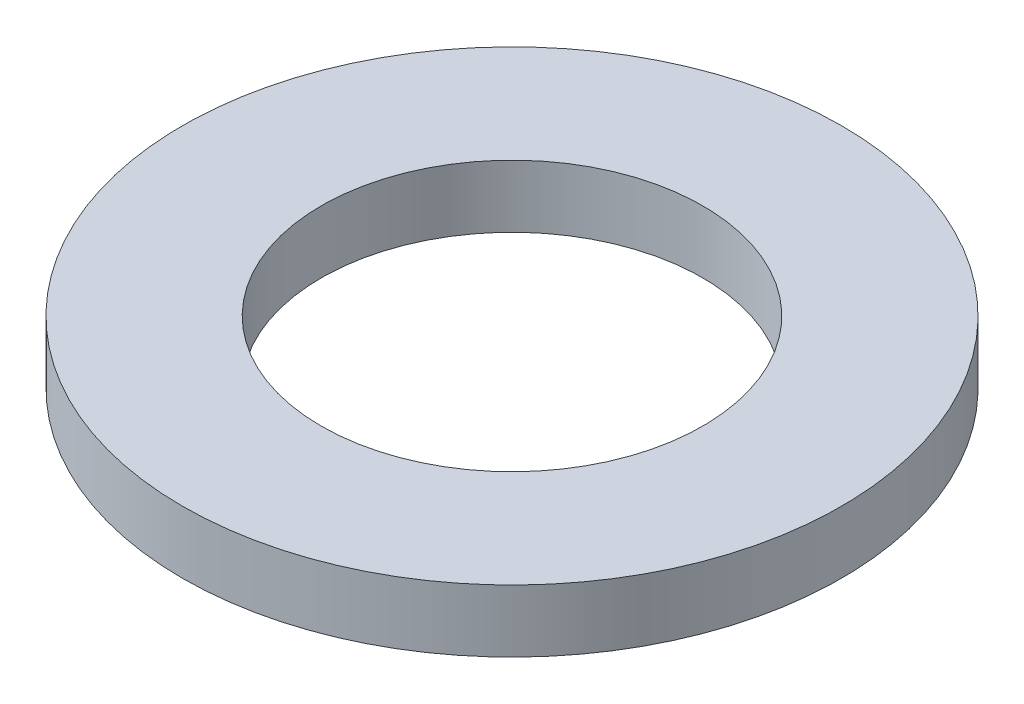
ISO-10303-21;
HEADER;
FILE_DESCRIPTION(('STEP AP214'),'2;1');
FILE_NAME('part.step','',(''),(''),'','','');
FILE_SCHEMA(('AUTOMOTIVE_DESIGN { 1 0 10303 214 1 1 1 1 }'));
ENDSEC;
DATA;
#1=APPLICATION_CONTEXT('core data for automotive mechanical design processes');
#2=APPLICATION_PROTOCOL_DEFINITION('international standard','automotive_design',2000,#1);
#3=PRODUCT_CONTEXT('',#1,'mechanical');
#4=PRODUCT('Part','Part','',(#3));
#5=PRODUCT_RELATED_PRODUCT_CATEGORY('part','',(#4));
#6=PRODUCT_DEFINITION_FORMATION('','',#4);
#7=PRODUCT_DEFINITION_CONTEXT('part definition',#1,'design');
#8=PRODUCT_DEFINITION('design','',#6,#7);
#9=PRODUCT_DEFINITION_SHAPE('','',#8);
#10=(LENGTH_UNIT() NAMED_UNIT(*) SI_UNIT(.MILLI.,.METRE.));
#11=(NAMED_UNIT(*) PLANE_ANGLE_UNIT() SI_UNIT($,.RADIAN.));
#12=(NAMED_UNIT(*) SI_UNIT($,.STERADIAN.) SOLID_ANGLE_UNIT());
#13=UNCERTAINTY_MEASURE_WITH_UNIT(LENGTH_MEASURE(1.E-05),#10,'distance_accuracy_value','');
#14=(GEOMETRIC_REPRESENTATION_CONTEXT(3) GLOBAL_UNCERTAINTY_ASSIGNED_CONTEXT((#13)) GLOBAL_UNIT_ASSIGNED_CONTEXT((#10,
#11,#12)) REPRESENTATION_CONTEXT('',''));
#15=CARTESIAN_POINT('',(0.,0.,0.));
#16=DIRECTION('',(0.,0.,1.));
#17=DIRECTION('',(1.,0.,0.));
#18=AXIS2_PLACEMENT_3D('',#15,#16,#17);
#19=CARTESIAN_POINT('',(0.,9.,0.));
#20=DIRECTION('',(0.,-1.,0.));
#21=DIRECTION('',(0.,0.,-1.));
#22=AXIS2_PLACEMENT_3D('',#19,#20,#21);
#23=CYLINDRICAL_SURFACE('',#22,47.5);
#24=CARTESIAN_POINT('',(0.,9.,0.));
#25=DIRECTION('',(0.,1.,0.));
#26=DIRECTION('',(0.,0.,1.));
#27=AXIS2_PLACEMENT_3D('',#24,#25,#26);
#28=CIRCLE('',#27,47.5);
#29=CARTESIAN_POINT('',(0.,9.,47.5));
#30=VERTEX_POINT('',#29);
#31=EDGE_CURVE('E10',#30,#30,#28,.T.);
#32=ORIENTED_EDGE('',*,*,#31,.F.);
#33=EDGE_LOOP('',(#32));
#34=FACE_BOUND('',#33,.T.);
#35=CARTESIAN_POINT('',(0.,0.,0.));
#36=DIRECTION('',(0.,1.,0.));
#37=DIRECTION('',(0.,0.,1.));
#38=AXIS2_PLACEMENT_3D('',#35,#36,#37);
#39=CIRCLE('',#38,47.5);
#40=CARTESIAN_POINT('',(0.,0.,47.5));
#41=VERTEX_POINT('',#40);
#42=EDGE_CURVE('E37',#41,#41,#39,.T.);
#43=ORIENTED_EDGE('',*,*,#42,.T.);
#44=EDGE_LOOP('',(#43));
#45=FACE_BOUND('',#44,.T.);
#46=ADVANCED_FACE('F40',(#34,#45),#23,.T.);
#47=CARTESIAN_POINT('',(0.,9.,0.));
#48=DIRECTION('',(0.,1.,0.));
#49=DIRECTION('',(0.,0.,1.));
#50=AXIS2_PLACEMENT_3D('',#47,#48,#49);
#51=PLANE('',#50);
#52=CARTESIAN_POINT('',(0.,9.,0.));
#53=DIRECTION('',(0.,1.,0.));
#54=DIRECTION('',(0.,0.,1.));
#55=AXIS2_PLACEMENT_3D('',#52,#53,#54);
#56=CIRCLE('',#55,27.5);
#57=CARTESIAN_POINT('',(0.,9.,27.5));
#58=VERTEX_POINT('',#57);
#59=EDGE_CURVE('E50',#58,#58,#56,.T.);
#60=ORIENTED_EDGE('',*,*,#59,.F.);
#61=EDGE_LOOP('',(#60));
#62=FACE_BOUND('',#61,.T.);
#63=ORIENTED_EDGE('',*,*,#31,.T.);
#64=EDGE_LOOP('',(#63));
#65=FACE_BOUND('',#64,.T.);
#66=ADVANCED_FACE('F59',(#62,#65),#51,.T.);
#67=CARTESIAN_POINT('',(0.,0.,0.));
#68=DIRECTION('',(0.,1.,0.));
#69=DIRECTION('',(0.,0.,1.));
#70=AXIS2_PLACEMENT_3D('',#67,#68,#69);
#71=PLANE('',#70);
#72=CARTESIAN_POINT('',(0.,0.,0.));
#73=DIRECTION('',(0.,1.,0.));
#74=DIRECTION('',(0.,0.,1.));
#75=AXIS2_PLACEMENT_3D('',#72,#73,#74);
#76=CIRCLE('',#75,27.5);
#77=CARTESIAN_POINT('',(0.,0.,27.5));
#78=VERTEX_POINT('',#77);
#79=EDGE_CURVE('E47',#78,#78,#76,.T.);
#80=ORIENTED_EDGE('',*,*,#79,.T.);
#81=EDGE_LOOP('',(#80));
#82=FACE_BOUND('',#81,.T.);
#83=ORIENTED_EDGE('',*,*,#42,.F.);
#84=EDGE_LOOP('',(#83));
#85=FACE_BOUND('',#84,.T.);
#86=ADVANCED_FACE('F58',(#82,#85),#71,.F.);
#87=CARTESIAN_POINT('',(0.,9.,0.));
#88=DIRECTION('',(0.,-1.,0.));
#89=DIRECTION('',(0.,0.,-1.));
#90=AXIS2_PLACEMENT_3D('',#87,#88,#89);
#91=CYLINDRICAL_SURFACE('',#90,27.5);
#92=ORIENTED_EDGE('',*,*,#59,.T.);
#93=EDGE_LOOP('',(#92));
#94=FACE_BOUND('',#93,.T.);
#95=ORIENTED_EDGE('',*,*,#79,.F.);
#96=EDGE_LOOP('',(#95));
#97=FACE_BOUND('',#96,.T.);
#98=ADVANCED_FACE('F54',(#94,#97),#91,.F.);
#99=CLOSED_SHELL('',(#46,#66,#86,#98));
#100=MANIFOLD_SOLID_BREP('B2',#99);
#101=ADVANCED_BREP_SHAPE_REPRESENTATION('',(#18,#100),#14);
#102=SHAPE_DEFINITION_REPRESENTATION(#9,#101);
ENDSEC;
END-ISO-10303-21;
